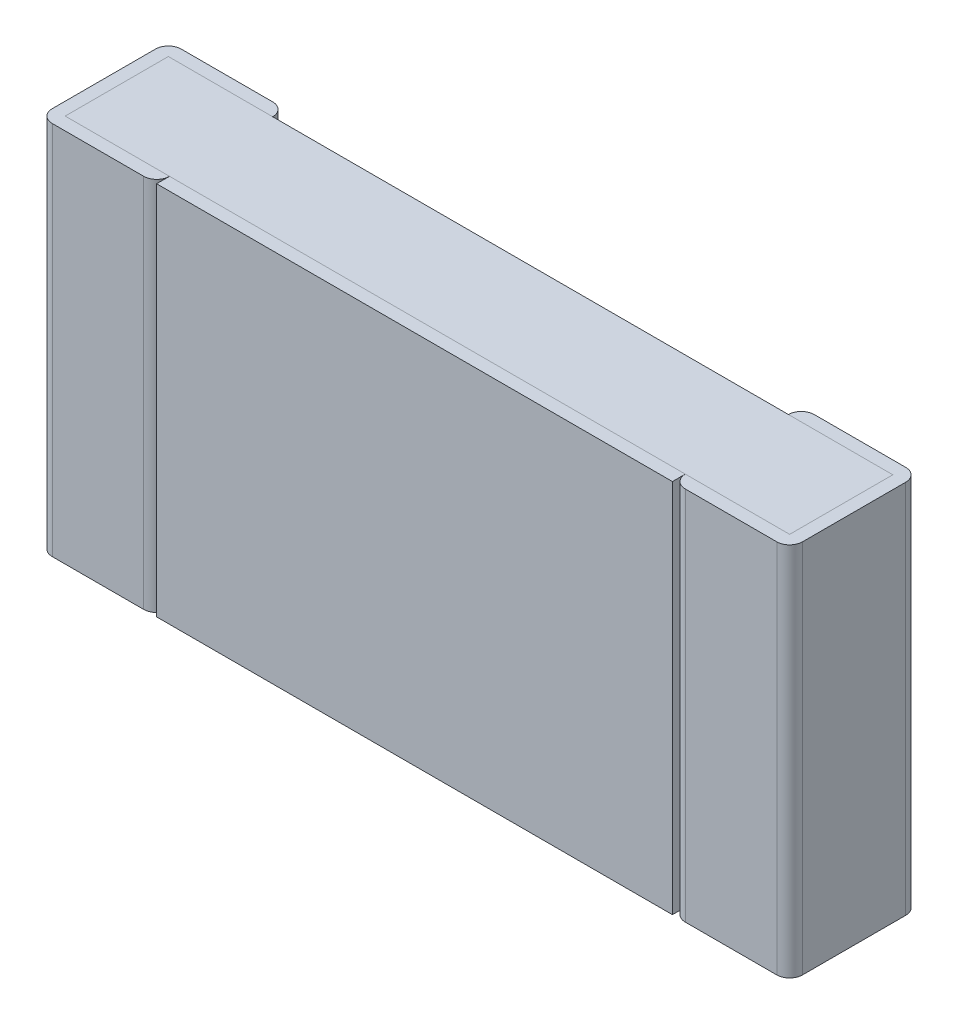
ISO-10303-21;
HEADER;
FILE_DESCRIPTION(('STEP AP214'),'2;1');
FILE_NAME('part.step','',(''),(''),'','','');
FILE_SCHEMA(('AUTOMOTIVE_DESIGN { 1 0 10303 214 1 1 1 1 }'));
ENDSEC;
DATA;
#1=APPLICATION_CONTEXT('core data for automotive mechanical design processes');
#2=APPLICATION_PROTOCOL_DEFINITION('international standard','automotive_design',2000,#1);
#3=PRODUCT_CONTEXT('',#1,'mechanical');
#4=PRODUCT('Part','Part','',(#3));
#5=PRODUCT_RELATED_PRODUCT_CATEGORY('part','',(#4));
#6=PRODUCT_DEFINITION_FORMATION('','',#4);
#7=PRODUCT_DEFINITION_CONTEXT('part definition',#1,'design');
#8=PRODUCT_DEFINITION('design','',#6,#7);
#9=PRODUCT_DEFINITION_SHAPE('','',#8);
#10=(LENGTH_UNIT() NAMED_UNIT(*) SI_UNIT(.MILLI.,.METRE.));
#11=(NAMED_UNIT(*) PLANE_ANGLE_UNIT() SI_UNIT($,.RADIAN.));
#12=(NAMED_UNIT(*) SI_UNIT($,.STERADIAN.) SOLID_ANGLE_UNIT());
#13=UNCERTAINTY_MEASURE_WITH_UNIT(LENGTH_MEASURE(1.E-05),#10,'distance_accuracy_value','');
#14=(GEOMETRIC_REPRESENTATION_CONTEXT(3) GLOBAL_UNCERTAINTY_ASSIGNED_CONTEXT((#13)) GLOBAL_UNIT_ASSIGNED_CONTEXT((#10,
#11,#12)) REPRESENTATION_CONTEXT('',''));
#15=CARTESIAN_POINT('',(0.,0.,0.));
#16=DIRECTION('',(0.,0.,1.));
#17=DIRECTION('',(1.,0.,0.));
#18=AXIS2_PLACEMENT_3D('',#15,#16,#17);
#19=CARTESIAN_POINT('',(-1.1,-0.8,0.55));
#20=DIRECTION('',(0.,0.,1.));
#21=DIRECTION('',(1.,0.,0.));
#22=AXIS2_PLACEMENT_3D('',#19,#20,#21);
#23=PLANE('',#22);
#24=DIRECTION('',(0.,1.,0.));
#25=VECTOR('',#24,1.);
#26=CARTESIAN_POINT('',(-1.1,-0.8,0.55));
#27=LINE('',#26,#25);
#28=CARTESIAN_POINT('',(-1.1,-0.8,0.55));
#29=VERTEX_POINT('',#28);
#30=CARTESIAN_POINT('',(-1.1,0.8,0.55));
#31=VERTEX_POINT('',#30);
#32=EDGE_CURVE('E253',#29,#31,#27,.T.);
#33=ORIENTED_EDGE('',*,*,#32,.F.);
#34=DIRECTION('',(1.,0.,0.));
#35=VECTOR('',#34,1.);
#36=CARTESIAN_POINT('',(-1.1,-0.8,0.55));
#37=LINE('',#36,#35);
#38=CARTESIAN_POINT('',(1.1,-0.8,0.55));
#39=VERTEX_POINT('',#38);
#40=EDGE_CURVE('E347',#29,#39,#37,.T.);
#41=ORIENTED_EDGE('',*,*,#40,.T.);
#42=DIRECTION('',(0.,1.,0.));
#43=VECTOR('',#42,1.);
#44=CARTESIAN_POINT('',(1.1,-0.8,0.55));
#45=LINE('',#44,#43);
#46=CARTESIAN_POINT('',(1.1,0.8,0.55));
#47=VERTEX_POINT('',#46);
#48=EDGE_CURVE('E11',#39,#47,#45,.T.);
#49=ORIENTED_EDGE('',*,*,#48,.T.);
#50=DIRECTION('',(1.,0.,0.));
#51=VECTOR('',#50,1.);
#52=CARTESIAN_POINT('',(-1.1,0.8,0.55));
#53=LINE('',#52,#51);
#54=EDGE_CURVE('E267',#31,#47,#53,.T.);
#55=ORIENTED_EDGE('',*,*,#54,.F.);
#56=EDGE_LOOP('',(#33,#41,#49,#55));
#57=FACE_BOUND('',#56,.T.);
#58=ADVANCED_FACE('F17',(#57),#23,.T.);
#59=CARTESIAN_POINT('',(1.1,-0.8,0.495));
#60=DIRECTION('',(1.,0.,0.));
#61=DIRECTION('',(0.,1.,0.));
#62=AXIS2_PLACEMENT_3D('',#59,#60,#61);
#63=PLANE('',#62);
#64=DIRECTION('',(0.,0.,1.));
#65=VECTOR('',#64,1.);
#66=CARTESIAN_POINT('',(1.1,-0.8,0.495));
#67=LINE('',#66,#65);
#68=CARTESIAN_POINT('',(1.1,-0.8,0.495));
#69=VERTEX_POINT('',#68);
#70=EDGE_CURVE('E392',#69,#39,#67,.T.);
#71=ORIENTED_EDGE('',*,*,#70,.F.);
#72=DIRECTION('',(0.,1.,0.));
#73=VECTOR('',#72,1.);
#74=CARTESIAN_POINT('',(1.1,-0.8,0.495));
#75=LINE('',#74,#73);
#76=CARTESIAN_POINT('',(1.1,0.8,0.495));
#77=VERTEX_POINT('',#76);
#78=EDGE_CURVE('E28',#69,#77,#75,.T.);
#79=ORIENTED_EDGE('',*,*,#78,.T.);
#80=DIRECTION('',(0.,0.,1.));
#81=VECTOR('',#80,1.);
#82=CARTESIAN_POINT('',(1.1,0.8,0.495));
#83=LINE('',#82,#81);
#84=EDGE_CURVE('E262',#77,#47,#83,.T.);
#85=ORIENTED_EDGE('',*,*,#84,.T.);
#86=ORIENTED_EDGE('',*,*,#48,.F.);
#87=EDGE_LOOP('',(#71,#79,#85,#86));
#88=FACE_BOUND('',#87,.T.);
#89=ADVANCED_FACE('F517',(#88),#63,.T.);
#90=CARTESIAN_POINT('',(1.155,-0.8,0.495));
#91=DIRECTION('',(0.,1.,0.));
#92=DIRECTION('',(-1.,0.,0.));
#93=AXIS2_PLACEMENT_3D('',#90,#91,#92);
#94=CYLINDRICAL_SURFACE('',#93,0.055);
#95=CARTESIAN_POINT('',(1.155,-0.8,0.495));
#96=DIRECTION('',(0.,1.,0.));
#97=DIRECTION('',(0.,0.,1.));
#98=AXIS2_PLACEMENT_3D('',#95,#96,#97);
#99=CIRCLE('',#98,0.055);
#100=CARTESIAN_POINT('',(1.155,-0.8,0.55));
#101=VERTEX_POINT('',#100);
#102=EDGE_CURVE('E339',#69,#101,#99,.T.);
#103=ORIENTED_EDGE('',*,*,#102,.T.);
#104=DIRECTION('',(0.,1.,0.));
#105=VECTOR('',#104,1.);
#106=CARTESIAN_POINT('',(1.155,-0.8,0.55));
#107=LINE('',#106,#105);
#108=CARTESIAN_POINT('',(1.155,0.8,0.55));
#109=VERTEX_POINT('',#108);
#110=EDGE_CURVE('E452',#101,#109,#107,.T.);
#111=ORIENTED_EDGE('',*,*,#110,.T.);
#112=CARTESIAN_POINT('',(1.155,0.8,0.495));
#113=DIRECTION('',(0.,1.,0.));
#114=DIRECTION('',(0.,0.,1.));
#115=AXIS2_PLACEMENT_3D('',#112,#113,#114);
#116=CIRCLE('',#115,0.055);
#117=EDGE_CURVE('E313',#77,#109,#116,.T.);
#118=ORIENTED_EDGE('',*,*,#117,.F.);
#119=ORIENTED_EDGE('',*,*,#78,.F.);
#120=EDGE_LOOP('',(#103,#111,#118,#119));
#121=FACE_BOUND('',#120,.T.);
#122=ADVANCED_FACE('F529',(#121),#94,.T.);
#123=CARTESIAN_POINT('',(1.1,-0.8,0.55));
#124=DIRECTION('',(0.,0.,1.));
#125=DIRECTION('',(1.,0.,0.));
#126=AXIS2_PLACEMENT_3D('',#123,#124,#125);
#127=PLANE('',#126);
#128=DIRECTION('',(1.,0.,0.));
#129=VECTOR('',#128,1.);
#130=CARTESIAN_POINT('',(1.1,0.8,0.55));
#131=LINE('',#130,#129);
#132=CARTESIAN_POINT('',(1.545,0.8,0.55));
#133=VERTEX_POINT('',#132);
#134=EDGE_CURVE('E320',#109,#133,#131,.T.);
#135=ORIENTED_EDGE('',*,*,#134,.F.);
#136=ORIENTED_EDGE('',*,*,#110,.F.);
#137=DIRECTION('',(1.,0.,0.));
#138=VECTOR('',#137,1.);
#139=CARTESIAN_POINT('',(1.1,-0.8,0.55));
#140=LINE('',#139,#138);
#141=CARTESIAN_POINT('',(1.545,-0.8,0.55));
#142=VERTEX_POINT('',#141);
#143=EDGE_CURVE('E21',#101,#142,#140,.T.);
#144=ORIENTED_EDGE('',*,*,#143,.T.);
#145=DIRECTION('',(0.,1.,0.));
#146=VECTOR('',#145,1.);
#147=CARTESIAN_POINT('',(1.545,-0.8,0.55));
#148=LINE('',#147,#146);
#149=EDGE_CURVE('E286',#142,#133,#148,.T.);
#150=ORIENTED_EDGE('',*,*,#149,.T.);
#151=EDGE_LOOP('',(#135,#136,#144,#150));
#152=FACE_BOUND('',#151,.T.);
#153=ADVANCED_FACE('F696',(#152),#127,.T.);
#154=CARTESIAN_POINT('',(1.545,-0.8,0.495));
#155=DIRECTION('',(0.,1.,0.));
#156=DIRECTION('',(1.,0.,0.));
#157=AXIS2_PLACEMENT_3D('',#154,#155,#156);
#158=CYLINDRICAL_SURFACE('',#157,0.055);
#159=DIRECTION('',(0.,1.,0.));
#160=VECTOR('',#159,1.);
#161=CARTESIAN_POINT('',(1.6,-0.8,0.495));
#162=LINE('',#161,#160);
#163=CARTESIAN_POINT('',(1.6,-0.8,0.495));
#164=VERTEX_POINT('',#163);
#165=CARTESIAN_POINT('',(1.6,0.8,0.495));
#166=VERTEX_POINT('',#165);
#167=EDGE_CURVE('E283',#164,#166,#162,.T.);
#168=ORIENTED_EDGE('',*,*,#167,.T.);
#169=CARTESIAN_POINT('',(1.545,0.8,0.495));
#170=DIRECTION('',(0.,-1.,0.));
#171=DIRECTION('',(0.,0.,1.));
#172=AXIS2_PLACEMENT_3D('',#169,#170,#171);
#173=CIRCLE('',#172,0.055);
#174=EDGE_CURVE('E328',#166,#133,#173,.T.);
#175=ORIENTED_EDGE('',*,*,#174,.T.);
#176=ORIENTED_EDGE('',*,*,#149,.F.);
#177=CARTESIAN_POINT('',(1.545,-0.8,0.495));
#178=DIRECTION('',(0.,-1.,0.));
#179=DIRECTION('',(0.,0.,1.));
#180=AXIS2_PLACEMENT_3D('',#177,#178,#179);
#181=CIRCLE('',#180,0.055);
#182=EDGE_CURVE('E353',#164,#142,#181,.T.);
#183=ORIENTED_EDGE('',*,*,#182,.F.);
#184=EDGE_LOOP('',(#168,#175,#176,#183));
#185=FACE_BOUND('',#184,.T.);
#186=ADVANCED_FACE('F691',(#185),#158,.T.);
#187=CARTESIAN_POINT('',(1.6,-0.8,0.));
#188=DIRECTION('',(1.,0.,0.));
#189=DIRECTION('',(0.,1.,0.));
#190=AXIS2_PLACEMENT_3D('',#187,#188,#189);
#191=PLANE('',#190);
#192=DIRECTION('',(0.,0.,1.));
#193=VECTOR('',#192,1.);
#194=CARTESIAN_POINT('',(1.6,-0.8,0.));
#195=LINE('',#194,#193);
#196=CARTESIAN_POINT('',(1.6,-0.8,0.055));
#197=VERTEX_POINT('',#196);
#198=EDGE_CURVE('E357',#197,#164,#195,.T.);
#199=ORIENTED_EDGE('',*,*,#198,.F.);
#200=DIRECTION('',(0.,1.,0.));
#201=VECTOR('',#200,1.);
#202=CARTESIAN_POINT('',(1.6,-0.8,0.055));
#203=LINE('',#202,#201);
#204=CARTESIAN_POINT('',(1.6,0.8,0.055));
#205=VERTEX_POINT('',#204);
#206=EDGE_CURVE('E287',#197,#205,#203,.T.);
#207=ORIENTED_EDGE('',*,*,#206,.T.);
#208=DIRECTION('',(0.,0.,1.));
#209=VECTOR('',#208,1.);
#210=CARTESIAN_POINT('',(1.6,0.8,0.));
#211=LINE('',#210,#209);
#212=EDGE_CURVE('E247',#205,#166,#211,.T.);
#213=ORIENTED_EDGE('',*,*,#212,.T.);
#214=ORIENTED_EDGE('',*,*,#167,.F.);
#215=EDGE_LOOP('',(#199,#207,#213,#214));
#216=FACE_BOUND('',#215,.T.);
#217=ADVANCED_FACE('F695',(#216),#191,.T.);
#218=CARTESIAN_POINT('',(1.545,-0.8,0.055));
#219=DIRECTION('',(0.,1.,0.));
#220=DIRECTION('',(1.,0.,0.));
#221=AXIS2_PLACEMENT_3D('',#218,#219,#220);
#222=CYLINDRICAL_SURFACE('',#221,0.055);
#223=CARTESIAN_POINT('',(1.545,-0.8,0.055));
#224=DIRECTION('',(0.,1.,0.));
#225=DIRECTION('',(0.,0.,1.));
#226=AXIS2_PLACEMENT_3D('',#223,#224,#225);
#227=CIRCLE('',#226,0.055);
#228=CARTESIAN_POINT('',(1.545,-0.8,0.));
#229=VERTEX_POINT('',#228);
#230=EDGE_CURVE('E368',#197,#229,#227,.T.);
#231=ORIENTED_EDGE('',*,*,#230,.T.);
#232=DIRECTION('',(0.,1.,0.));
#233=VECTOR('',#232,1.);
#234=CARTESIAN_POINT('',(1.545,-0.8,0.));
#235=LINE('',#234,#233);
#236=CARTESIAN_POINT('',(1.545,0.8,0.));
#237=VERTEX_POINT('',#236);
#238=EDGE_CURVE('E261',#229,#237,#235,.T.);
#239=ORIENTED_EDGE('',*,*,#238,.T.);
#240=CARTESIAN_POINT('',(1.545,0.8,0.055));
#241=DIRECTION('',(0.,1.,0.));
#242=DIRECTION('',(0.,0.,1.));
#243=AXIS2_PLACEMENT_3D('',#240,#241,#242);
#244=CIRCLE('',#243,0.055);
#245=EDGE_CURVE('E263',#205,#237,#244,.T.);
#246=ORIENTED_EDGE('',*,*,#245,.F.);
#247=ORIENTED_EDGE('',*,*,#206,.F.);
#248=EDGE_LOOP('',(#231,#239,#246,#247));
#249=FACE_BOUND('',#248,.T.);
#250=ADVANCED_FACE('F464',(#249),#222,.T.);
#251=CARTESIAN_POINT('',(1.1,-0.8,0.));
#252=DIRECTION('',(0.,0.,1.));
#253=DIRECTION('',(1.,0.,0.));
#254=AXIS2_PLACEMENT_3D('',#251,#252,#253);
#255=PLANE('',#254);
#256=ORIENTED_EDGE('',*,*,#238,.F.);
#257=DIRECTION('',(1.,0.,0.));
#258=VECTOR('',#257,1.);
#259=CARTESIAN_POINT('',(1.1,-0.8,0.));
#260=LINE('',#259,#258);
#261=CARTESIAN_POINT('',(1.155,-0.8,0.));
#262=VERTEX_POINT('',#261);
#263=EDGE_CURVE('E396',#262,#229,#260,.T.);
#264=ORIENTED_EDGE('',*,*,#263,.F.);
#265=DIRECTION('',(0.,1.,0.));
#266=VECTOR('',#265,1.);
#267=CARTESIAN_POINT('',(1.155,-0.8,0.));
#268=LINE('',#267,#266);
#269=CARTESIAN_POINT('',(1.155,0.8,0.));
#270=VERTEX_POINT('',#269);
#271=EDGE_CURVE('E258',#262,#270,#268,.T.);
#272=ORIENTED_EDGE('',*,*,#271,.T.);
#273=DIRECTION('',(1.,0.,0.));
#274=VECTOR('',#273,1.);
#275=CARTESIAN_POINT('',(1.1,0.8,0.));
#276=LINE('',#275,#274);
#277=EDGE_CURVE('E252',#270,#237,#276,.T.);
#278=ORIENTED_EDGE('',*,*,#277,.T.);
#279=EDGE_LOOP('',(#256,#264,#272,#278));
#280=FACE_BOUND('',#279,.T.);
#281=ADVANCED_FACE('F470',(#280),#255,.F.);
#282=CARTESIAN_POINT('',(1.155,-0.8,0.055));
#283=DIRECTION('',(0.,1.,0.));
#284=DIRECTION('',(-1.,0.,0.));
#285=AXIS2_PLACEMENT_3D('',#282,#283,#284);
#286=CYLINDRICAL_SURFACE('',#285,0.055);
#287=DIRECTION('',(0.,1.,0.));
#288=VECTOR('',#287,1.);
#289=CARTESIAN_POINT('',(1.1,-0.8,0.055));
#290=LINE('',#289,#288);
#291=CARTESIAN_POINT('',(1.1,-0.8,0.055));
#292=VERTEX_POINT('',#291);
#293=CARTESIAN_POINT('',(1.1,0.8,0.055));
#294=VERTEX_POINT('',#293);
#295=EDGE_CURVE('E375',#292,#294,#290,.T.);
#296=ORIENTED_EDGE('',*,*,#295,.T.);
#297=CARTESIAN_POINT('',(1.155,0.8,0.055));
#298=DIRECTION('',(0.,-1.,0.));
#299=DIRECTION('',(0.,0.,1.));
#300=AXIS2_PLACEMENT_3D('',#297,#298,#299);
#301=CIRCLE('',#300,0.055);
#302=EDGE_CURVE('E299',#294,#270,#301,.T.);
#303=ORIENTED_EDGE('',*,*,#302,.T.);
#304=ORIENTED_EDGE('',*,*,#271,.F.);
#305=CARTESIAN_POINT('',(1.155,-0.8,0.055));
#306=DIRECTION('',(0.,-1.,0.));
#307=DIRECTION('',(0.,0.,1.));
#308=AXIS2_PLACEMENT_3D('',#305,#306,#307);
#309=CIRCLE('',#308,0.055);
#310=EDGE_CURVE('E343',#292,#262,#309,.T.);
#311=ORIENTED_EDGE('',*,*,#310,.F.);
#312=EDGE_LOOP('',(#296,#303,#304,#311));
#313=FACE_BOUND('',#312,.T.);
#314=ADVANCED_FACE('F471',(#313),#286,.T.);
#315=CARTESIAN_POINT('',(-1.1,0.8,0.495));
#316=DIRECTION('',(0.,1.,0.));
#317=DIRECTION('',(1.,0.,0.));
#318=AXIS2_PLACEMENT_3D('',#315,#316,#317);
#319=PLANE('',#318);
#320=DIRECTION('',(1.,0.,0.));
#321=VECTOR('',#320,1.);
#322=CARTESIAN_POINT('',(-1.1,0.8,0.495));
#323=LINE('',#322,#321);
#324=CARTESIAN_POINT('',(-1.1,0.8,0.495));
#325=VERTEX_POINT('',#324);
#326=EDGE_CURVE('E236',#325,#77,#323,.T.);
#327=ORIENTED_EDGE('',*,*,#326,.F.);
#328=DIRECTION('',(0.,0.,1.));
#329=VECTOR('',#328,1.);
#330=CARTESIAN_POINT('',(-1.1,0.8,0.495));
#331=LINE('',#330,#329);
#332=EDGE_CURVE('E249',#325,#31,#331,.T.);
#333=ORIENTED_EDGE('',*,*,#332,.T.);
#334=ORIENTED_EDGE('',*,*,#54,.T.);
#335=ORIENTED_EDGE('',*,*,#84,.F.);
#336=EDGE_LOOP('',(#327,#333,#334,#335));
#337=FACE_BOUND('',#336,.T.);
#338=ADVANCED_FACE('F538',(#337),#319,.T.);
#339=CARTESIAN_POINT('',(1.1,0.8,0.));
#340=DIRECTION('',(0.,1.,0.));
#341=DIRECTION('',(1.,0.,0.));
#342=AXIS2_PLACEMENT_3D('',#339,#340,#341);
#343=PLANE('',#342);
#344=ORIENTED_EDGE('',*,*,#277,.F.);
#345=ORIENTED_EDGE('',*,*,#302,.F.);
#346=DIRECTION('',(1.,0.,0.));
#347=VECTOR('',#346,1.);
#348=CARTESIAN_POINT('',(-1.545,0.8,0.055));
#349=LINE('',#348,#347);
#350=CARTESIAN_POINT('',(1.545,0.8,0.055));
#351=VERTEX_POINT('',#350);
#352=EDGE_CURVE('E229',#294,#351,#349,.T.);
#353=ORIENTED_EDGE('',*,*,#352,.T.);
#354=DIRECTION('',(0.,0.,1.));
#355=VECTOR('',#354,1.);
#356=CARTESIAN_POINT('',(1.545,0.8,0.055));
#357=LINE('',#356,#355);
#358=CARTESIAN_POINT('',(1.545,0.8,0.495));
#359=VERTEX_POINT('',#358);
#360=EDGE_CURVE('E221',#351,#359,#357,.T.);
#361=ORIENTED_EDGE('',*,*,#360,.T.);
#362=DIRECTION('',(1.,0.,0.));
#363=VECTOR('',#362,1.);
#364=CARTESIAN_POINT('',(-1.545,0.8,0.495));
#365=LINE('',#364,#363);
#366=EDGE_CURVE('E226',#77,#359,#365,.T.);
#367=ORIENTED_EDGE('',*,*,#366,.F.);
#368=ORIENTED_EDGE('',*,*,#117,.T.);
#369=ORIENTED_EDGE('',*,*,#134,.T.);
#370=ORIENTED_EDGE('',*,*,#174,.F.);
#371=ORIENTED_EDGE('',*,*,#212,.F.);
#372=ORIENTED_EDGE('',*,*,#245,.T.);
#373=EDGE_LOOP('',(#344,#345,#353,#361,#367,#368,#369,#370,#371,#372));
#374=FACE_BOUND('',#373,.T.);
#375=ADVANCED_FACE('F224',(#374),#343,.T.);
#376=CARTESIAN_POINT('',(-1.1,-0.8,0.495));
#377=DIRECTION('',(1.,0.,0.));
#378=DIRECTION('',(0.,1.,0.));
#379=AXIS2_PLACEMENT_3D('',#376,#377,#378);
#380=PLANE('',#379);
#381=ORIENTED_EDGE('',*,*,#32,.T.);
#382=ORIENTED_EDGE('',*,*,#332,.F.);
#383=DIRECTION('',(0.,1.,0.));
#384=VECTOR('',#383,1.);
#385=CARTESIAN_POINT('',(-1.1,-0.8,0.495));
#386=LINE('',#385,#384);
#387=CARTESIAN_POINT('',(-1.1,-0.8,0.495));
#388=VERTEX_POINT('',#387);
#389=EDGE_CURVE('E332',#388,#325,#386,.T.);
#390=ORIENTED_EDGE('',*,*,#389,.F.);
#391=DIRECTION('',(0.,0.,1.));
#392=VECTOR('',#391,1.);
#393=CARTESIAN_POINT('',(-1.1,-0.8,0.495));
#394=LINE('',#393,#392);
#395=EDGE_CURVE('E344',#388,#29,#394,.T.);
#396=ORIENTED_EDGE('',*,*,#395,.T.);
#397=EDGE_LOOP('',(#381,#382,#390,#396));
#398=FACE_BOUND('',#397,.T.);
#399=ADVANCED_FACE('F553',(#398),#380,.F.);
#400=CARTESIAN_POINT('',(-1.1,-0.8,0.495));
#401=DIRECTION('',(0.,1.,0.));
#402=DIRECTION('',(1.,0.,0.));
#403=AXIS2_PLACEMENT_3D('',#400,#401,#402);
#404=PLANE('',#403);
#405=ORIENTED_EDGE('',*,*,#70,.T.);
#406=ORIENTED_EDGE('',*,*,#40,.F.);
#407=ORIENTED_EDGE('',*,*,#395,.F.);
#408=DIRECTION('',(1.,0.,0.));
#409=VECTOR('',#408,1.);
#410=CARTESIAN_POINT('',(-1.1,-0.8,0.495));
#411=LINE('',#410,#409);
#412=EDGE_CURVE('E386',#388,#69,#411,.T.);
#413=ORIENTED_EDGE('',*,*,#412,.T.);
#414=EDGE_LOOP('',(#405,#406,#407,#413));
#415=FACE_BOUND('',#414,.T.);
#416=ADVANCED_FACE('F558',(#415),#404,.F.);
#417=CARTESIAN_POINT('',(1.1,-0.8,0.));
#418=DIRECTION('',(0.,1.,0.));
#419=DIRECTION('',(1.,0.,0.));
#420=AXIS2_PLACEMENT_3D('',#417,#418,#419);
#421=PLANE('',#420);
#422=ORIENTED_EDGE('',*,*,#230,.F.);
#423=ORIENTED_EDGE('',*,*,#198,.T.);
#424=ORIENTED_EDGE('',*,*,#182,.T.);
#425=ORIENTED_EDGE('',*,*,#143,.F.);
#426=ORIENTED_EDGE('',*,*,#102,.F.);
#427=DIRECTION('',(1.,0.,0.));
#428=VECTOR('',#427,1.);
#429=CARTESIAN_POINT('',(-1.545,-0.8,0.495));
#430=LINE('',#429,#428);
#431=CARTESIAN_POINT('',(1.545,-0.8,0.495));
#432=VERTEX_POINT('',#431);
#433=EDGE_CURVE('E389',#69,#432,#430,.T.);
#434=ORIENTED_EDGE('',*,*,#433,.T.);
#435=DIRECTION('',(0.,0.,1.));
#436=VECTOR('',#435,1.);
#437=CARTESIAN_POINT('',(1.545,-0.8,0.055));
#438=LINE('',#437,#436);
#439=CARTESIAN_POINT('',(1.545,-0.8,0.055));
#440=VERTEX_POINT('',#439);
#441=EDGE_CURVE('E291',#440,#432,#438,.T.);
#442=ORIENTED_EDGE('',*,*,#441,.F.);
#443=DIRECTION('',(1.,0.,0.));
#444=VECTOR('',#443,1.);
#445=CARTESIAN_POINT('',(-1.545,-0.8,0.055));
#446=LINE('',#445,#444);
#447=EDGE_CURVE('E288',#292,#440,#446,.T.);
#448=ORIENTED_EDGE('',*,*,#447,.F.);
#449=ORIENTED_EDGE('',*,*,#310,.T.);
#450=ORIENTED_EDGE('',*,*,#263,.T.);
#451=EDGE_LOOP('',(#422,#423,#424,#425,#426,#434,#442,#448,#449,#450));
#452=FACE_BOUND('',#451,.T.);
#453=ADVANCED_FACE('F569',(#452),#421,.F.);
#454=CARTESIAN_POINT('',(-1.545,-0.8,0.055));
#455=DIRECTION('',(0.,0.,1.));
#456=DIRECTION('',(1.,0.,0.));
#457=AXIS2_PLACEMENT_3D('',#454,#455,#456);
#458=PLANE('',#457);
#459=DIRECTION('',(1.,0.,0.));
#460=VECTOR('',#459,1.);
#461=CARTESIAN_POINT('',(-1.545,0.8,0.055));
#462=LINE('',#461,#460);
#463=CARTESIAN_POINT('',(-1.1,0.8,0.055));
#464=VERTEX_POINT('',#463);
#465=EDGE_CURVE('E310',#464,#294,#462,.T.);
#466=ORIENTED_EDGE('',*,*,#465,.T.);
#467=ORIENTED_EDGE('',*,*,#295,.F.);
#468=DIRECTION('',(1.,0.,0.));
#469=VECTOR('',#468,1.);
#470=CARTESIAN_POINT('',(-1.545,-0.8,0.055));
#471=LINE('',#470,#469);
#472=CARTESIAN_POINT('',(-1.1,-0.8,0.055));
#473=VERTEX_POINT('',#472);
#474=EDGE_CURVE('E105',#473,#292,#471,.T.);
#475=ORIENTED_EDGE('',*,*,#474,.F.);
#476=DIRECTION('',(0.,1.,0.));
#477=VECTOR('',#476,1.);
#478=CARTESIAN_POINT('',(-1.1,-0.8,0.055));
#479=LINE('',#478,#477);
#480=EDGE_CURVE('E349',#473,#464,#479,.T.);
#481=ORIENTED_EDGE('',*,*,#480,.T.);
#482=EDGE_LOOP('',(#466,#467,#475,#481));
#483=FACE_BOUND('',#482,.T.);
#484=ADVANCED_FACE('F578',(#483),#458,.F.);
#485=CARTESIAN_POINT('',(-1.545,0.8,0.055));
#486=DIRECTION('',(0.,1.,0.));
#487=DIRECTION('',(1.,0.,0.));
#488=AXIS2_PLACEMENT_3D('',#485,#486,#487);
#489=PLANE('',#488);
#490=DIRECTION('',(1.,0.,0.));
#491=VECTOR('',#490,1.);
#492=CARTESIAN_POINT('',(-1.545,0.8,0.055));
#493=LINE('',#492,#491);
#494=CARTESIAN_POINT('',(-1.545,0.8,0.055));
#495=VERTEX_POINT('',#494);
#496=EDGE_CURVE('E842',#495,#464,#493,.T.);
#497=ORIENTED_EDGE('',*,*,#496,.F.);
#498=DIRECTION('',(0.,0.,1.));
#499=VECTOR('',#498,1.);
#500=CARTESIAN_POINT('',(-1.545,0.8,0.055));
#501=LINE('',#500,#499);
#502=CARTESIAN_POINT('',(-1.545,0.8,0.495));
#503=VERTEX_POINT('',#502);
#504=EDGE_CURVE('E271',#495,#503,#501,.T.);
#505=ORIENTED_EDGE('',*,*,#504,.T.);
#506=DIRECTION('',(1.,0.,0.));
#507=VECTOR('',#506,1.);
#508=CARTESIAN_POINT('',(-1.545,0.8,0.495));
#509=LINE('',#508,#507);
#510=EDGE_CURVE('E268',#503,#325,#509,.T.);
#511=ORIENTED_EDGE('',*,*,#510,.T.);
#512=ORIENTED_EDGE('',*,*,#326,.T.);
#513=ORIENTED_EDGE('',*,*,#366,.T.);
#514=ORIENTED_EDGE('',*,*,#360,.F.);
#515=ORIENTED_EDGE('',*,*,#352,.F.);
#516=ORIENTED_EDGE('',*,*,#465,.F.);
#517=EDGE_LOOP('',(#497,#505,#511,#512,#513,#514,#515,#516));
#518=FACE_BOUND('',#517,.T.);
#519=ADVANCED_FACE('F233',(#518),#489,.T.);
#520=CARTESIAN_POINT('',(-1.6,-0.8,0.55));
#521=DIRECTION('',(0.,0.,1.));
#522=DIRECTION('',(1.,0.,0.));
#523=AXIS2_PLACEMENT_3D('',#520,#521,#522);
#524=PLANE('',#523);
#525=DIRECTION('',(1.,0.,0.));
#526=VECTOR('',#525,1.);
#527=CARTESIAN_POINT('',(-1.6,0.8,0.55));
#528=LINE('',#527,#526);
#529=CARTESIAN_POINT('',(-1.545,0.8,0.55));
#530=VERTEX_POINT('',#529);
#531=CARTESIAN_POINT('',(-1.155,0.8,0.55));
#532=VERTEX_POINT('',#531);
#533=EDGE_CURVE('E337',#530,#532,#528,.T.);
#534=ORIENTED_EDGE('',*,*,#533,.F.);
#535=DIRECTION('',(0.,1.,0.));
#536=VECTOR('',#535,1.);
#537=CARTESIAN_POINT('',(-1.545,-0.8,0.55));
#538=LINE('',#537,#536);
#539=CARTESIAN_POINT('',(-1.545,-0.8,0.55));
#540=VERTEX_POINT('',#539);
#541=EDGE_CURVE('E361',#540,#530,#538,.T.);
#542=ORIENTED_EDGE('',*,*,#541,.F.);
#543=DIRECTION('',(1.,0.,0.));
#544=VECTOR('',#543,1.);
#545=CARTESIAN_POINT('',(-1.6,-0.8,0.55));
#546=LINE('',#545,#544);
#547=CARTESIAN_POINT('',(-1.155,-0.8,0.55));
#548=VERTEX_POINT('',#547);
#549=EDGE_CURVE('E276',#540,#548,#546,.T.);
#550=ORIENTED_EDGE('',*,*,#549,.T.);
#551=DIRECTION('',(0.,1.,0.));
#552=VECTOR('',#551,1.);
#553=CARTESIAN_POINT('',(-1.155,-0.8,0.55));
#554=LINE('',#553,#552);
#555=EDGE_CURVE('E243',#548,#532,#554,.T.);
#556=ORIENTED_EDGE('',*,*,#555,.T.);
#557=EDGE_LOOP('',(#534,#542,#550,#556));
#558=FACE_BOUND('',#557,.T.);
#559=ADVANCED_FACE('F592',(#558),#524,.T.);
#560=CARTESIAN_POINT('',(-1.155,-0.8,0.495));
#561=DIRECTION('',(0.,1.,0.));
#562=DIRECTION('',(1.,0.,0.));
#563=AXIS2_PLACEMENT_3D('',#560,#561,#562);
#564=CYLINDRICAL_SURFACE('',#563,0.055);
#565=ORIENTED_EDGE('',*,*,#389,.T.);
#566=CARTESIAN_POINT('',(-1.155,0.8,0.495));
#567=DIRECTION('',(0.,-1.,0.));
#568=DIRECTION('',(0.,0.,1.));
#569=AXIS2_PLACEMENT_3D('',#566,#567,#568);
#570=CIRCLE('',#569,0.055);
#571=EDGE_CURVE('E272',#325,#532,#570,.T.);
#572=ORIENTED_EDGE('',*,*,#571,.T.);
#573=ORIENTED_EDGE('',*,*,#555,.F.);
#574=CARTESIAN_POINT('',(-1.155,-0.8,0.495));
#575=DIRECTION('',(0.,-1.,0.));
#576=DIRECTION('',(0.,0.,1.));
#577=AXIS2_PLACEMENT_3D('',#574,#575,#576);
#578=CIRCLE('',#577,0.055);
#579=EDGE_CURVE('E300',#388,#548,#578,.T.);
#580=ORIENTED_EDGE('',*,*,#579,.F.);
#581=EDGE_LOOP('',(#565,#572,#573,#580));
#582=FACE_BOUND('',#581,.T.);
#583=ADVANCED_FACE('F605',(#582),#564,.T.);
#584=CARTESIAN_POINT('',(-1.545,-0.8,0.055));
#585=DIRECTION('',(0.,1.,0.));
#586=DIRECTION('',(1.,0.,0.));
#587=AXIS2_PLACEMENT_3D('',#584,#585,#586);
#588=PLANE('',#587);
#589=ORIENTED_EDGE('',*,*,#474,.T.);
#590=ORIENTED_EDGE('',*,*,#447,.T.);
#591=ORIENTED_EDGE('',*,*,#441,.T.);
#592=ORIENTED_EDGE('',*,*,#433,.F.);
#593=ORIENTED_EDGE('',*,*,#412,.F.);
#594=DIRECTION('',(1.,0.,0.));
#595=VECTOR('',#594,1.);
#596=CARTESIAN_POINT('',(-1.545,-0.8,0.495));
#597=LINE('',#596,#595);
#598=CARTESIAN_POINT('',(-1.545,-0.8,0.495));
#599=VERTEX_POINT('',#598);
#600=EDGE_CURVE('E304',#599,#388,#597,.T.);
#601=ORIENTED_EDGE('',*,*,#600,.F.);
#602=DIRECTION('',(0.,0.,1.));
#603=VECTOR('',#602,1.);
#604=CARTESIAN_POINT('',(-1.545,-0.8,0.055));
#605=LINE('',#604,#603);
#606=CARTESIAN_POINT('',(-1.545,-0.8,0.055));
#607=VERTEX_POINT('',#606);
#608=EDGE_CURVE('E305',#607,#599,#605,.T.);
#609=ORIENTED_EDGE('',*,*,#608,.F.);
#610=DIRECTION('',(1.,0.,0.));
#611=VECTOR('',#610,1.);
#612=CARTESIAN_POINT('',(-1.545,-0.8,0.055));
#613=LINE('',#612,#611);
#614=EDGE_CURVE('E281',#607,#473,#613,.T.);
#615=ORIENTED_EDGE('',*,*,#614,.T.);
#616=EDGE_LOOP('',(#589,#590,#591,#592,#593,#601,#609,#615));
#617=FACE_BOUND('',#616,.T.);
#618=ADVANCED_FACE('F600',(#617),#588,.F.);
#619=CARTESIAN_POINT('',(-1.155,-0.8,0.055));
#620=DIRECTION('',(0.,1.,0.));
#621=DIRECTION('',(1.,0.,0.));
#622=AXIS2_PLACEMENT_3D('',#619,#620,#621);
#623=CYLINDRICAL_SURFACE('',#622,0.055);
#624=CARTESIAN_POINT('',(-1.155,-0.8,0.055));
#625=DIRECTION('',(0.,1.,0.));
#626=DIRECTION('',(0.,0.,1.));
#627=AXIS2_PLACEMENT_3D('',#624,#625,#626);
#628=CIRCLE('',#627,0.055);
#629=CARTESIAN_POINT('',(-1.155,-0.8,0.));
#630=VERTEX_POINT('',#629);
#631=EDGE_CURVE('E277',#473,#630,#628,.T.);
#632=ORIENTED_EDGE('',*,*,#631,.T.);
#633=DIRECTION('',(0.,1.,0.));
#634=VECTOR('',#633,1.);
#635=CARTESIAN_POINT('',(-1.155,-0.8,0.));
#636=LINE('',#635,#634);
#637=CARTESIAN_POINT('',(-1.155,0.8,0.));
#638=VERTEX_POINT('',#637);
#639=EDGE_CURVE('E351',#630,#638,#636,.T.);
#640=ORIENTED_EDGE('',*,*,#639,.T.);
#641=CARTESIAN_POINT('',(-1.155,0.8,0.055));
#642=DIRECTION('',(0.,1.,0.));
#643=DIRECTION('',(0.,0.,1.));
#644=AXIS2_PLACEMENT_3D('',#641,#642,#643);
#645=CIRCLE('',#644,0.055);
#646=EDGE_CURVE('E846',#464,#638,#645,.T.);
#647=ORIENTED_EDGE('',*,*,#646,.F.);
#648=ORIENTED_EDGE('',*,*,#480,.F.);
#649=EDGE_LOOP('',(#632,#640,#647,#648));
#650=FACE_BOUND('',#649,.T.);
#651=ADVANCED_FACE('F604',(#650),#623,.T.);
#652=CARTESIAN_POINT('',(-1.6,-0.8,0.));
#653=DIRECTION('',(0.,0.,1.));
#654=DIRECTION('',(1.,0.,0.));
#655=AXIS2_PLACEMENT_3D('',#652,#653,#654);
#656=PLANE('',#655);
#657=ORIENTED_EDGE('',*,*,#639,.F.);
#658=DIRECTION('',(1.,0.,0.));
#659=VECTOR('',#658,1.);
#660=CARTESIAN_POINT('',(-1.6,-0.8,0.));
#661=LINE('',#660,#659);
#662=CARTESIAN_POINT('',(-1.545,-0.8,0.));
#663=VERTEX_POINT('',#662);
#664=EDGE_CURVE('E256',#663,#630,#661,.T.);
#665=ORIENTED_EDGE('',*,*,#664,.F.);
#666=DIRECTION('',(0.,1.,0.));
#667=VECTOR('',#666,1.);
#668=CARTESIAN_POINT('',(-1.545,-0.8,0.));
#669=LINE('',#668,#667);
#670=CARTESIAN_POINT('',(-1.545,0.8,0.));
#671=VERTEX_POINT('',#670);
#672=EDGE_CURVE('E407',#663,#671,#669,.T.);
#673=ORIENTED_EDGE('',*,*,#672,.T.);
#674=DIRECTION('',(1.,0.,0.));
#675=VECTOR('',#674,1.);
#676=CARTESIAN_POINT('',(-1.6,0.8,0.));
#677=LINE('',#676,#675);
#678=EDGE_CURVE('E334',#671,#638,#677,.T.);
#679=ORIENTED_EDGE('',*,*,#678,.T.);
#680=EDGE_LOOP('',(#657,#665,#673,#679));
#681=FACE_BOUND('',#680,.T.);
#682=ADVANCED_FACE('F621',(#681),#656,.F.);
#683=CARTESIAN_POINT('',(-1.6,0.8,0.));
#684=DIRECTION('',(0.,1.,0.));
#685=DIRECTION('',(1.,0.,0.));
#686=AXIS2_PLACEMENT_3D('',#683,#684,#685);
#687=PLANE('',#686);
#688=ORIENTED_EDGE('',*,*,#678,.F.);
#689=CARTESIAN_POINT('',(-1.545,0.8,0.055));
#690=DIRECTION('',(0.,-1.,0.));
#691=DIRECTION('',(0.,0.,1.));
#692=AXIS2_PLACEMENT_3D('',#689,#690,#691);
#693=CIRCLE('',#692,0.055);
#694=CARTESIAN_POINT('',(-1.6,0.8,0.055));
#695=VERTEX_POINT('',#694);
#696=EDGE_CURVE('E410',#695,#671,#693,.T.);
#697=ORIENTED_EDGE('',*,*,#696,.F.);
#698=DIRECTION('',(0.,0.,1.));
#699=VECTOR('',#698,1.);
#700=CARTESIAN_POINT('',(-1.6,0.8,0.));
#701=LINE('',#700,#699);
#702=CARTESIAN_POINT('',(-1.6,0.8,0.495));
#703=VERTEX_POINT('',#702);
#704=EDGE_CURVE('E430',#695,#703,#701,.T.);
#705=ORIENTED_EDGE('',*,*,#704,.T.);
#706=CARTESIAN_POINT('',(-1.545,0.8,0.495));
#707=DIRECTION('',(0.,1.,0.));
#708=DIRECTION('',(0.,0.,1.));
#709=AXIS2_PLACEMENT_3D('',#706,#707,#708);
#710=CIRCLE('',#709,0.055);
#711=EDGE_CURVE('E338',#703,#530,#710,.T.);
#712=ORIENTED_EDGE('',*,*,#711,.T.);
#713=ORIENTED_EDGE('',*,*,#533,.T.);
#714=ORIENTED_EDGE('',*,*,#571,.F.);
#715=ORIENTED_EDGE('',*,*,#510,.F.);
#716=ORIENTED_EDGE('',*,*,#504,.F.);
#717=ORIENTED_EDGE('',*,*,#496,.T.);
#718=ORIENTED_EDGE('',*,*,#646,.T.);
#719=EDGE_LOOP('',(#688,#697,#705,#712,#713,#714,#715,#716,#717,#718));
#720=FACE_BOUND('',#719,.T.);
#721=ADVANCED_FACE('F630',(#720),#687,.T.);
#722=CARTESIAN_POINT('',(-1.545,-0.8,0.495));
#723=DIRECTION('',(0.,1.,0.));
#724=DIRECTION('',(-1.,0.,0.));
#725=AXIS2_PLACEMENT_3D('',#722,#723,#724);
#726=CYLINDRICAL_SURFACE('',#725,0.055);
#727=CARTESIAN_POINT('',(-1.545,-0.8,0.495));
#728=DIRECTION('',(0.,1.,0.));
#729=DIRECTION('',(0.,0.,1.));
#730=AXIS2_PLACEMENT_3D('',#727,#728,#729);
#731=CIRCLE('',#730,0.055);
#732=CARTESIAN_POINT('',(-1.6,-0.8,0.495));
#733=VERTEX_POINT('',#732);
#734=EDGE_CURVE('E257',#733,#540,#731,.T.);
#735=ORIENTED_EDGE('',*,*,#734,.T.);
#736=ORIENTED_EDGE('',*,*,#541,.T.);
#737=ORIENTED_EDGE('',*,*,#711,.F.);
#738=DIRECTION('',(0.,1.,0.));
#739=VECTOR('',#738,1.);
#740=CARTESIAN_POINT('',(-1.6,-0.8,0.495));
#741=LINE('',#740,#739);
#742=EDGE_CURVE('E436',#733,#703,#741,.T.);
#743=ORIENTED_EDGE('',*,*,#742,.F.);
#744=EDGE_LOOP('',(#735,#736,#737,#743));
#745=FACE_BOUND('',#744,.T.);
#746=ADVANCED_FACE('F638',(#745),#726,.T.);
#747=CARTESIAN_POINT('',(-1.545,-0.8,0.055));
#748=DIRECTION('',(0.,1.,0.));
#749=DIRECTION('',(-1.,0.,0.));
#750=AXIS2_PLACEMENT_3D('',#747,#748,#749);
#751=CYLINDRICAL_SURFACE('',#750,0.055);
#752=DIRECTION('',(0.,1.,0.));
#753=VECTOR('',#752,1.);
#754=CARTESIAN_POINT('',(-1.6,-0.8,0.055));
#755=LINE('',#754,#753);
#756=CARTESIAN_POINT('',(-1.6,-0.8,0.055));
#757=VERTEX_POINT('',#756);
#758=EDGE_CURVE('E406',#757,#695,#755,.T.);
#759=ORIENTED_EDGE('',*,*,#758,.T.);
#760=ORIENTED_EDGE('',*,*,#696,.T.);
#761=ORIENTED_EDGE('',*,*,#672,.F.);
#762=CARTESIAN_POINT('',(-1.545,-0.8,0.055));
#763=DIRECTION('',(0.,-1.,0.));
#764=DIRECTION('',(0.,0.,1.));
#765=AXIS2_PLACEMENT_3D('',#762,#763,#764);
#766=CIRCLE('',#765,0.055);
#767=EDGE_CURVE('E119',#757,#663,#766,.T.);
#768=ORIENTED_EDGE('',*,*,#767,.F.);
#769=EDGE_LOOP('',(#759,#760,#761,#768));
#770=FACE_BOUND('',#769,.T.);
#771=ADVANCED_FACE('F646',(#770),#751,.T.);
#772=CARTESIAN_POINT('',(-1.6,-0.8,0.));
#773=DIRECTION('',(0.,1.,0.));
#774=DIRECTION('',(1.,0.,0.));
#775=AXIS2_PLACEMENT_3D('',#772,#773,#774);
#776=PLANE('',#775);
#777=ORIENTED_EDGE('',*,*,#631,.F.);
#778=ORIENTED_EDGE('',*,*,#614,.F.);
#779=ORIENTED_EDGE('',*,*,#608,.T.);
#780=ORIENTED_EDGE('',*,*,#600,.T.);
#781=ORIENTED_EDGE('',*,*,#579,.T.);
#782=ORIENTED_EDGE('',*,*,#549,.F.);
#783=ORIENTED_EDGE('',*,*,#734,.F.);
#784=DIRECTION('',(0.,0.,1.));
#785=VECTOR('',#784,1.);
#786=CARTESIAN_POINT('',(-1.6,-0.8,0.));
#787=LINE('',#786,#785);
#788=EDGE_CURVE('E282',#757,#733,#787,.T.);
#789=ORIENTED_EDGE('',*,*,#788,.F.);
#790=ORIENTED_EDGE('',*,*,#767,.T.);
#791=ORIENTED_EDGE('',*,*,#664,.T.);
#792=EDGE_LOOP('',(#777,#778,#779,#780,#781,#782,#783,#789,#790,#791));
#793=FACE_BOUND('',#792,.T.);
#794=ADVANCED_FACE('F19',(#793),#776,.F.);
#795=CARTESIAN_POINT('',(-1.6,-0.8,0.));
#796=DIRECTION('',(1.,0.,0.));
#797=DIRECTION('',(0.,1.,0.));
#798=AXIS2_PLACEMENT_3D('',#795,#796,#797);
#799=PLANE('',#798);
#800=ORIENTED_EDGE('',*,*,#742,.T.);
#801=ORIENTED_EDGE('',*,*,#704,.F.);
#802=ORIENTED_EDGE('',*,*,#758,.F.);
#803=ORIENTED_EDGE('',*,*,#788,.T.);
#804=EDGE_LOOP('',(#800,#801,#802,#803));
#805=FACE_BOUND('',#804,.T.);
#806=ADVANCED_FACE('F662',(#805),#799,.F.);
#807=CLOSED_SHELL('',(#58,#89,#122,#153,#186,#217,#250,#281,#314,#338,#375,#399,#416,#453,#484,
#519,#559,#583,#618,#651,#682,#721,#746,#771,#794,#806));
#808=MANIFOLD_SOLID_BREP('B1',#807);
#809=ADVANCED_BREP_SHAPE_REPRESENTATION('',(#18,#808),#14);
#810=SHAPE_DEFINITION_REPRESENTATION(#9,#809);
ENDSEC;
END-ISO-10303-21;
